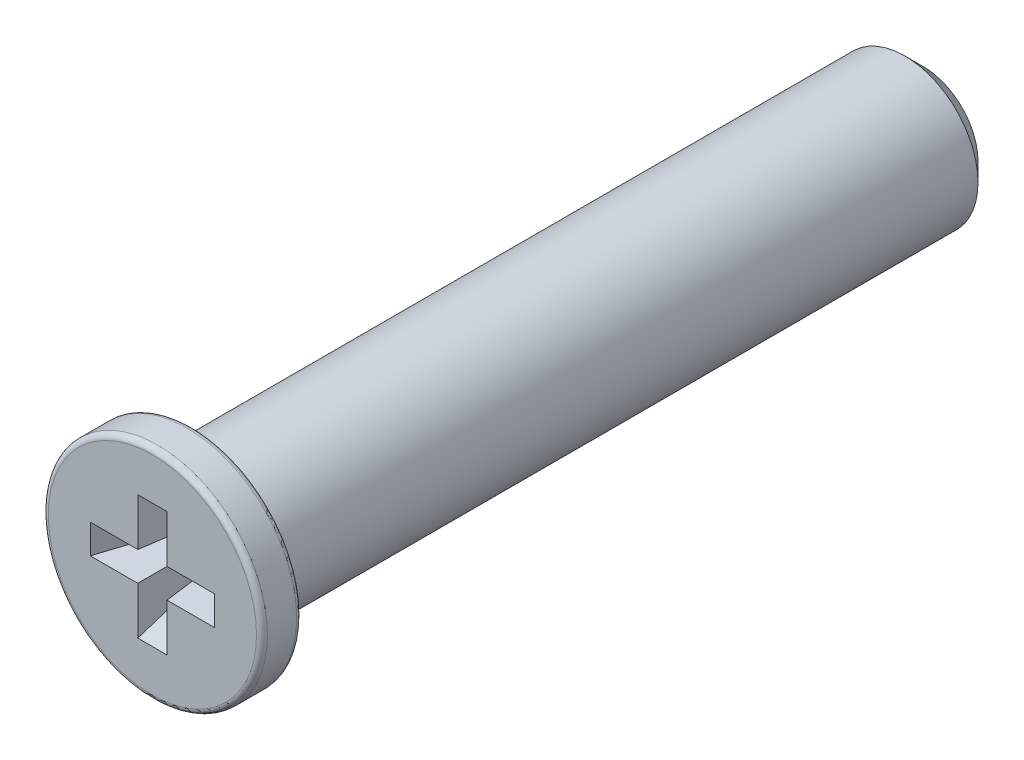
ISO-10303-21;
HEADER;
FILE_DESCRIPTION(('STEP AP214'),'2;1');
FILE_NAME('part.step','',(''),(''),'','','');
FILE_SCHEMA(('AUTOMOTIVE_DESIGN { 1 0 10303 214 1 1 1 1 }'));
ENDSEC;
DATA;
#1=APPLICATION_CONTEXT('core data for automotive mechanical design processes');
#2=APPLICATION_PROTOCOL_DEFINITION('international standard','automotive_design',2000,#1);
#3=PRODUCT_CONTEXT('',#1,'mechanical');
#4=PRODUCT('Part','Part','',(#3));
#5=PRODUCT_RELATED_PRODUCT_CATEGORY('part','',(#4));
#6=PRODUCT_DEFINITION_FORMATION('','',#4);
#7=PRODUCT_DEFINITION_CONTEXT('part definition',#1,'design');
#8=PRODUCT_DEFINITION('design','',#6,#7);
#9=PRODUCT_DEFINITION_SHAPE('','',#8);
#10=(LENGTH_UNIT() NAMED_UNIT(*) SI_UNIT(.MILLI.,.METRE.));
#11=(NAMED_UNIT(*) PLANE_ANGLE_UNIT() SI_UNIT($,.RADIAN.));
#12=(NAMED_UNIT(*) SI_UNIT($,.STERADIAN.) SOLID_ANGLE_UNIT());
#13=UNCERTAINTY_MEASURE_WITH_UNIT(LENGTH_MEASURE(1.E-05),#10,'distance_accuracy_value','');
#14=(GEOMETRIC_REPRESENTATION_CONTEXT(3) GLOBAL_UNCERTAINTY_ASSIGNED_CONTEXT((#13)) GLOBAL_UNIT_ASSIGNED_CONTEXT((#10,
#11,#12)) REPRESENTATION_CONTEXT('',''));
#15=CARTESIAN_POINT('',(0.,0.,0.));
#16=DIRECTION('',(0.,0.,1.));
#17=DIRECTION('',(1.,0.,0.));
#18=AXIS2_PLACEMENT_3D('',#15,#16,#17);
#19=CARTESIAN_POINT('',(12.1,-11.25,7.5));
#20=DIRECTION('',(-0.923879532511287,0.,0.38268343236509));
#21=DIRECTION('',(0.38268343236509,0.,0.923879532511287));
#22=AXIS2_PLACEMENT_3D('',#19,#20,#21);
#23=PLANE('',#22);
#24=DIRECTION('',(0.,1.,0.));
#25=VECTOR('',#24,1.);
#26=CARTESIAN_POINT('',(11.6029437251523,-11.25,6.30000000000001));
#27=LINE('',#26,#25);
#28=CARTESIAN_POINT('',(11.6029437251523,-11.1339121743322,6.3));
#29=VERTEX_POINT('',#28);
#30=CARTESIAN_POINT('',(11.6029437251523,-11.3660878256678,6.3));
#31=VERTEX_POINT('',#30);
#32=EDGE_CURVE('E117',#29,#31,#27,.F.);
#33=ORIENTED_EDGE('',*,*,#32,.T.);
#34=DIRECTION('',(-0.381887326256782,0.0644695530821726,-0.921957562347547));
#35=VECTOR('',#34,1.);
#36=CARTESIAN_POINT('',(12.1,-11.45,7.5));
#37=LINE('',#36,#35);
#38=CARTESIAN_POINT('',(12.1,-11.45,7.5));
#39=VERTEX_POINT('',#38);
#40=EDGE_CURVE('E133',#39,#31,#37,.T.);
#41=ORIENTED_EDGE('',*,*,#40,.F.);
#42=DIRECTION('',(0.,1.,0.));
#43=VECTOR('',#42,1.);
#44=CARTESIAN_POINT('',(12.1,-11.25,7.5));
#45=LINE('',#44,#43);
#46=CARTESIAN_POINT('',(12.1,-11.05,7.5));
#47=VERTEX_POINT('',#46);
#48=EDGE_CURVE('E122',#39,#47,#45,.T.);
#49=ORIENTED_EDGE('',*,*,#48,.T.);
#50=DIRECTION('',(0.381887326256781,0.0644695530821739,0.921957562347547));
#51=VECTOR('',#50,1.);
#52=CARTESIAN_POINT('',(11.6029437251523,-11.1339121743322,6.3));
#53=LINE('',#52,#51);
#54=EDGE_CURVE('E286',#29,#47,#53,.T.);
#55=ORIENTED_EDGE('',*,*,#54,.F.);
#56=EDGE_LOOP('',(#33,#41,#49,#55));
#57=FACE_BOUND('',#56,.T.);
#58=ADVANCED_FACE('F17',(#57),#23,.T.);
#59=CARTESIAN_POINT('',(11.25,-11.45,7.5));
#60=DIRECTION('',(0.,0.997564050259824,0.0697564737441253));
#61=DIRECTION('',(0.,-0.0697564737441253,0.997564050259824));
#62=AXIS2_PLACEMENT_3D('',#59,#60,#61);
#63=PLANE('',#62);
#64=DIRECTION('',(1.,0.,0.));
#65=VECTOR('',#64,1.);
#66=CARTESIAN_POINT('',(11.25,-11.3660878256678,6.3));
#67=LINE('',#66,#65);
#68=CARTESIAN_POINT('',(11.3660878256678,-11.3660878256678,6.3));
#69=VERTEX_POINT('',#68);
#70=EDGE_CURVE('E135',#31,#69,#67,.F.);
#71=ORIENTED_EDGE('',*,*,#70,.T.);
#72=DIRECTION('',(-0.0695873743166644,0.0695873743166544,-0.995145815783509));
#73=VECTOR('',#72,1.);
#74=CARTESIAN_POINT('',(11.45,-11.45,7.5));
#75=LINE('',#74,#73);
#76=CARTESIAN_POINT('',(11.45,-11.45,7.5));
#77=VERTEX_POINT('',#76);
#78=EDGE_CURVE('E139',#77,#69,#75,.T.);
#79=ORIENTED_EDGE('',*,*,#78,.F.);
#80=DIRECTION('',(1.,0.,0.));
#81=VECTOR('',#80,1.);
#82=CARTESIAN_POINT('',(11.25,-11.45,7.5));
#83=LINE('',#82,#81);
#84=EDGE_CURVE('E126',#77,#39,#83,.T.);
#85=ORIENTED_EDGE('',*,*,#84,.T.);
#86=ORIENTED_EDGE('',*,*,#40,.T.);
#87=EDGE_LOOP('',(#71,#79,#85,#86));
#88=FACE_BOUND('',#87,.T.);
#89=ADVANCED_FACE('F137',(#88),#63,.T.);
#90=CARTESIAN_POINT('',(11.25,-11.05,7.5));
#91=DIRECTION('',(0.,-0.997564050259824,0.0697564737441253));
#92=DIRECTION('',(0.,-0.0697564737441253,-0.997564050259824));
#93=AXIS2_PLACEMENT_3D('',#90,#91,#92);
#94=PLANE('',#93);
#95=DIRECTION('',(1.,0.,0.));
#96=VECTOR('',#95,1.);
#97=CARTESIAN_POINT('',(11.25,-11.1339121743322,6.3));
#98=LINE('',#97,#96);
#99=CARTESIAN_POINT('',(11.3660878256678,-11.1339121743322,6.3));
#100=VERTEX_POINT('',#99);
#101=EDGE_CURVE('E288',#100,#29,#98,.T.);
#102=ORIENTED_EDGE('',*,*,#101,.T.);
#103=ORIENTED_EDGE('',*,*,#54,.T.);
#104=DIRECTION('',(1.,0.,0.));
#105=VECTOR('',#104,1.);
#106=CARTESIAN_POINT('',(11.25,-11.05,7.5));
#107=LINE('',#106,#105);
#108=CARTESIAN_POINT('',(11.45,-11.05,7.5));
#109=VERTEX_POINT('',#108);
#110=EDGE_CURVE('E129',#47,#109,#107,.F.);
#111=ORIENTED_EDGE('',*,*,#110,.T.);
#112=DIRECTION('',(0.0695873743166644,0.0695873743166544,0.995145815783509));
#113=VECTOR('',#112,1.);
#114=CARTESIAN_POINT('',(11.3660878256678,-11.1339121743322,6.3));
#115=LINE('',#114,#113);
#116=EDGE_CURVE('E272',#100,#109,#115,.T.);
#117=ORIENTED_EDGE('',*,*,#116,.F.);
#118=EDGE_LOOP('',(#102,#103,#111,#117));
#119=FACE_BOUND('',#118,.T.);
#120=ADVANCED_FACE('F459',(#119),#94,.T.);
#121=CARTESIAN_POINT('',(11.45,-11.25,7.5));
#122=DIRECTION('',(-0.997564050259824,0.,0.0697564737441253));
#123=DIRECTION('',(0.0697564737441253,0.,0.997564050259824));
#124=AXIS2_PLACEMENT_3D('',#121,#122,#123);
#125=PLANE('',#124);
#126=DIRECTION('',(0.,1.,0.));
#127=VECTOR('',#126,1.);
#128=CARTESIAN_POINT('',(11.3660878256678,-11.25,6.3));
#129=LINE('',#128,#127);
#130=CARTESIAN_POINT('',(11.3660878256678,-11.6029437251523,6.3));
#131=VERTEX_POINT('',#130);
#132=EDGE_CURVE('E281',#69,#131,#129,.F.);
#133=ORIENTED_EDGE('',*,*,#132,.T.);
#134=DIRECTION('',(-0.0644695530821646,0.381887326256791,-0.921957562347544));
#135=VECTOR('',#134,1.);
#136=CARTESIAN_POINT('',(11.45,-12.1,7.5));
#137=LINE('',#136,#135);
#138=CARTESIAN_POINT('',(11.45,-12.1,7.5));
#139=VERTEX_POINT('',#138);
#140=EDGE_CURVE('E266',#139,#131,#137,.T.);
#141=ORIENTED_EDGE('',*,*,#140,.F.);
#142=DIRECTION('',(0.,1.,0.));
#143=VECTOR('',#142,1.);
#144=CARTESIAN_POINT('',(11.45,-11.25,7.5));
#145=LINE('',#144,#143);
#146=EDGE_CURVE('E284',#139,#77,#145,.T.);
#147=ORIENTED_EDGE('',*,*,#146,.T.);
#148=ORIENTED_EDGE('',*,*,#78,.T.);
#149=EDGE_LOOP('',(#133,#141,#147,#148));
#150=FACE_BOUND('',#149,.T.);
#151=ADVANCED_FACE('F298',(#150),#125,.T.);
#152=CARTESIAN_POINT('',(11.45,-11.25,7.5));
#153=DIRECTION('',(-0.997564050259824,0.,0.0697564737441253));
#154=DIRECTION('',(0.0697564737441253,0.,0.997564050259824));
#155=AXIS2_PLACEMENT_3D('',#152,#153,#154);
#156=PLANE('',#155);
#157=DIRECTION('',(0.,1.,0.));
#158=VECTOR('',#157,1.);
#159=CARTESIAN_POINT('',(11.3660878256678,-11.25,6.3));
#160=LINE('',#159,#158);
#161=CARTESIAN_POINT('',(11.3660878256678,-10.8970562748477,6.3));
#162=VERTEX_POINT('',#161);
#163=EDGE_CURVE('E275',#162,#100,#160,.F.);
#164=ORIENTED_EDGE('',*,*,#163,.T.);
#165=ORIENTED_EDGE('',*,*,#116,.T.);
#166=DIRECTION('',(0.,1.,0.));
#167=VECTOR('',#166,1.);
#168=CARTESIAN_POINT('',(11.45,-11.25,7.5));
#169=LINE('',#168,#167);
#170=CARTESIAN_POINT('',(11.45,-10.4,7.5));
#171=VERTEX_POINT('',#170);
#172=EDGE_CURVE('E278',#109,#171,#169,.T.);
#173=ORIENTED_EDGE('',*,*,#172,.T.);
#174=DIRECTION('',(0.0644695530821647,0.381887326256791,0.921957562347544));
#175=VECTOR('',#174,1.);
#176=CARTESIAN_POINT('',(11.3660878256678,-10.8970562748477,6.30000000000001));
#177=LINE('',#176,#175);
#178=EDGE_CURVE('E255',#162,#171,#177,.T.);
#179=ORIENTED_EDGE('',*,*,#178,.F.);
#180=EDGE_LOOP('',(#164,#165,#173,#179));
#181=FACE_BOUND('',#180,.T.);
#182=ADVANCED_FACE('F445',(#181),#156,.T.);
#183=CARTESIAN_POINT('',(11.25,-12.1,7.5));
#184=DIRECTION('',(0.,0.923879532511287,0.38268343236509));
#185=DIRECTION('',(0.,-0.38268343236509,0.923879532511287));
#186=AXIS2_PLACEMENT_3D('',#183,#184,#185);
#187=PLANE('',#186);
#188=DIRECTION('',(1.,0.,0.));
#189=VECTOR('',#188,1.);
#190=CARTESIAN_POINT('',(11.25,-11.6029437251523,6.30000000000001));
#191=LINE('',#190,#189);
#192=CARTESIAN_POINT('',(11.1339121743322,-11.6029437251523,6.3));
#193=VERTEX_POINT('',#192);
#194=EDGE_CURVE('E264',#131,#193,#191,.F.);
#195=ORIENTED_EDGE('',*,*,#194,.T.);
#196=DIRECTION('',(0.0644695530821726,0.381887326256782,-0.921957562347547));
#197=VECTOR('',#196,1.);
#198=CARTESIAN_POINT('',(11.05,-12.1,7.5));
#199=LINE('',#198,#197);
#200=CARTESIAN_POINT('',(11.05,-12.1,7.5));
#201=VERTEX_POINT('',#200);
#202=EDGE_CURVE('E249',#201,#193,#199,.T.);
#203=ORIENTED_EDGE('',*,*,#202,.F.);
#204=DIRECTION('',(1.,0.,0.));
#205=VECTOR('',#204,1.);
#206=CARTESIAN_POINT('',(11.25,-12.1,7.5));
#207=LINE('',#206,#205);
#208=EDGE_CURVE('E269',#201,#139,#207,.T.);
#209=ORIENTED_EDGE('',*,*,#208,.T.);
#210=ORIENTED_EDGE('',*,*,#140,.T.);
#211=EDGE_LOOP('',(#195,#203,#209,#210));
#212=FACE_BOUND('',#211,.T.);
#213=ADVANCED_FACE('F302',(#212),#187,.T.);
#214=CARTESIAN_POINT('',(11.25,-10.4,7.5));
#215=DIRECTION('',(0.,-0.923879532511287,0.38268343236509));
#216=DIRECTION('',(0.,-0.38268343236509,-0.923879532511287));
#217=AXIS2_PLACEMENT_3D('',#214,#215,#216);
#218=PLANE('',#217);
#219=DIRECTION('',(1.,0.,0.));
#220=VECTOR('',#219,1.);
#221=CARTESIAN_POINT('',(11.25,-10.8970562748477,6.30000000000001));
#222=LINE('',#221,#220);
#223=CARTESIAN_POINT('',(11.1339121743322,-10.8970562748477,6.3));
#224=VERTEX_POINT('',#223);
#225=EDGE_CURVE('E258',#224,#162,#222,.T.);
#226=ORIENTED_EDGE('',*,*,#225,.T.);
#227=ORIENTED_EDGE('',*,*,#178,.T.);
#228=DIRECTION('',(1.,0.,0.));
#229=VECTOR('',#228,1.);
#230=CARTESIAN_POINT('',(11.25,-10.4,7.5));
#231=LINE('',#230,#229);
#232=CARTESIAN_POINT('',(11.05,-10.4,7.5));
#233=VERTEX_POINT('',#232);
#234=EDGE_CURVE('E261',#171,#233,#231,.F.);
#235=ORIENTED_EDGE('',*,*,#234,.T.);
#236=DIRECTION('',(-0.064469553082174,0.38188732625678,0.921957562347548));
#237=VECTOR('',#236,1.);
#238=CARTESIAN_POINT('',(11.1339121743322,-10.8970562748477,6.3));
#239=LINE('',#238,#237);
#240=EDGE_CURVE('E241',#224,#233,#239,.T.);
#241=ORIENTED_EDGE('',*,*,#240,.F.);
#242=EDGE_LOOP('',(#226,#227,#235,#241));
#243=FACE_BOUND('',#242,.T.);
#244=ADVANCED_FACE('F431',(#243),#218,.T.);
#245=CARTESIAN_POINT('',(11.05,-11.25,7.5));
#246=DIRECTION('',(0.997564050259824,0.,0.0697564737441253));
#247=DIRECTION('',(0.0697564737441253,0.,-0.997564050259824));
#248=AXIS2_PLACEMENT_3D('',#245,#246,#247);
#249=PLANE('',#248);
#250=DIRECTION('',(0.,1.,0.));
#251=VECTOR('',#250,1.);
#252=CARTESIAN_POINT('',(11.1339121743322,-11.25,6.3));
#253=LINE('',#252,#251);
#254=CARTESIAN_POINT('',(11.1339121743322,-11.3660878256678,6.3));
#255=VERTEX_POINT('',#254);
#256=EDGE_CURVE('E247',#193,#255,#253,.T.);
#257=ORIENTED_EDGE('',*,*,#256,.T.);
#258=DIRECTION('',(0.0695873743166544,0.0695873743166644,-0.995145815783509));
#259=VECTOR('',#258,1.);
#260=CARTESIAN_POINT('',(11.05,-11.45,7.5));
#261=LINE('',#260,#259);
#262=CARTESIAN_POINT('',(11.05,-11.45,7.5));
#263=VERTEX_POINT('',#262);
#264=EDGE_CURVE('E235',#263,#255,#261,.T.);
#265=ORIENTED_EDGE('',*,*,#264,.F.);
#266=DIRECTION('',(0.,1.,0.));
#267=VECTOR('',#266,1.);
#268=CARTESIAN_POINT('',(11.05,-11.25,7.5));
#269=LINE('',#268,#267);
#270=EDGE_CURVE('E252',#263,#201,#269,.F.);
#271=ORIENTED_EDGE('',*,*,#270,.T.);
#272=ORIENTED_EDGE('',*,*,#202,.T.);
#273=EDGE_LOOP('',(#257,#265,#271,#272));
#274=FACE_BOUND('',#273,.T.);
#275=ADVANCED_FACE('F304',(#274),#249,.T.);
#276=CARTESIAN_POINT('',(11.05,-11.25,7.5));
#277=DIRECTION('',(0.997564050259824,0.,0.0697564737441253));
#278=DIRECTION('',(0.0697564737441253,0.,-0.997564050259824));
#279=AXIS2_PLACEMENT_3D('',#276,#277,#278);
#280=PLANE('',#279);
#281=DIRECTION('',(0.,1.,0.));
#282=VECTOR('',#281,1.);
#283=CARTESIAN_POINT('',(11.1339121743322,-11.25,6.3));
#284=LINE('',#283,#282);
#285=CARTESIAN_POINT('',(11.1339121743322,-11.1339121743322,6.3));
#286=VERTEX_POINT('',#285);
#287=EDGE_CURVE('E230',#224,#286,#284,.F.);
#288=ORIENTED_EDGE('',*,*,#287,.F.);
#289=ORIENTED_EDGE('',*,*,#240,.T.);
#290=DIRECTION('',(0.,1.,0.));
#291=VECTOR('',#290,1.);
#292=CARTESIAN_POINT('',(11.05,-11.25,7.5));
#293=LINE('',#292,#291);
#294=CARTESIAN_POINT('',(11.05,-11.05,7.5));
#295=VERTEX_POINT('',#294);
#296=EDGE_CURVE('E244',#233,#295,#293,.F.);
#297=ORIENTED_EDGE('',*,*,#296,.T.);
#298=DIRECTION('',(-0.0695873743166544,0.0695873743166644,0.995145815783509));
#299=VECTOR('',#298,1.);
#300=CARTESIAN_POINT('',(11.1339121743322,-11.1339121743322,6.3));
#301=LINE('',#300,#299);
#302=EDGE_CURVE('E222',#286,#295,#301,.T.);
#303=ORIENTED_EDGE('',*,*,#302,.F.);
#304=EDGE_LOOP('',(#288,#289,#297,#303));
#305=FACE_BOUND('',#304,.T.);
#306=ADVANCED_FACE('F417',(#305),#280,.T.);
#307=CARTESIAN_POINT('',(11.25,-11.45,7.5));
#308=DIRECTION('',(0.,0.997564050259824,0.0697564737441253));
#309=DIRECTION('',(0.,-0.0697564737441253,0.997564050259824));
#310=AXIS2_PLACEMENT_3D('',#307,#308,#309);
#311=PLANE('',#310);
#312=DIRECTION('',(1.,0.,0.));
#313=VECTOR('',#312,1.);
#314=CARTESIAN_POINT('',(11.25,-11.3660878256678,6.3));
#315=LINE('',#314,#313);
#316=CARTESIAN_POINT('',(10.8970562748477,-11.3660878256678,6.3));
#317=VERTEX_POINT('',#316);
#318=EDGE_CURVE('E232',#317,#255,#315,.T.);
#319=ORIENTED_EDGE('',*,*,#318,.F.);
#320=DIRECTION('',(0.381887326256791,0.0644695530821647,-0.921957562347544));
#321=VECTOR('',#320,1.);
#322=CARTESIAN_POINT('',(10.4,-11.45,7.5));
#323=LINE('',#322,#321);
#324=CARTESIAN_POINT('',(10.4,-11.45,7.5));
#325=VERTEX_POINT('',#324);
#326=EDGE_CURVE('E219',#325,#317,#323,.T.);
#327=ORIENTED_EDGE('',*,*,#326,.F.);
#328=DIRECTION('',(1.,0.,0.));
#329=VECTOR('',#328,1.);
#330=CARTESIAN_POINT('',(11.25,-11.45,7.5));
#331=LINE('',#330,#329);
#332=EDGE_CURVE('E238',#325,#263,#331,.T.);
#333=ORIENTED_EDGE('',*,*,#332,.T.);
#334=ORIENTED_EDGE('',*,*,#264,.T.);
#335=EDGE_LOOP('',(#319,#327,#333,#334));
#336=FACE_BOUND('',#335,.T.);
#337=ADVANCED_FACE('F307',(#336),#311,.T.);
#338=CARTESIAN_POINT('',(11.25,-11.25,6.3));
#339=DIRECTION('',(0.,0.,1.));
#340=DIRECTION('',(1.,0.,0.));
#341=AXIS2_PLACEMENT_3D('',#338,#339,#340);
#342=PLANE('',#341);
#343=ORIENTED_EDGE('',*,*,#225,.F.);
#344=ORIENTED_EDGE('',*,*,#287,.T.);
#345=DIRECTION('',(1.,0.,0.));
#346=VECTOR('',#345,1.);
#347=CARTESIAN_POINT('',(11.25,-11.1339121743322,6.3));
#348=LINE('',#347,#346);
#349=CARTESIAN_POINT('',(10.8970562748477,-11.1339121743322,6.3));
#350=VERTEX_POINT('',#349);
#351=EDGE_CURVE('E225',#350,#286,#348,.T.);
#352=ORIENTED_EDGE('',*,*,#351,.F.);
#353=DIRECTION('',(0.,1.,0.));
#354=VECTOR('',#353,1.);
#355=CARTESIAN_POINT('',(10.8970562748477,-11.25,6.30000000000001));
#356=LINE('',#355,#354);
#357=EDGE_CURVE('E216',#317,#350,#356,.T.);
#358=ORIENTED_EDGE('',*,*,#357,.F.);
#359=ORIENTED_EDGE('',*,*,#318,.T.);
#360=ORIENTED_EDGE('',*,*,#256,.F.);
#361=ORIENTED_EDGE('',*,*,#194,.F.);
#362=ORIENTED_EDGE('',*,*,#132,.F.);
#363=ORIENTED_EDGE('',*,*,#70,.F.);
#364=ORIENTED_EDGE('',*,*,#32,.F.);
#365=ORIENTED_EDGE('',*,*,#101,.F.);
#366=ORIENTED_EDGE('',*,*,#163,.F.);
#367=EDGE_LOOP('',(#343,#344,#352,#358,#359,#360,#361,#362,#363,#364,#365,#366));
#368=FACE_BOUND('',#367,.T.);
#369=ADVANCED_FACE('F294',(#368),#342,.T.);
#370=CARTESIAN_POINT('',(11.25,-11.05,7.5));
#371=DIRECTION('',(0.,-0.997564050259824,0.0697564737441253));
#372=DIRECTION('',(0.,-0.0697564737441253,-0.997564050259824));
#373=AXIS2_PLACEMENT_3D('',#370,#371,#372);
#374=PLANE('',#373);
#375=ORIENTED_EDGE('',*,*,#351,.T.);
#376=ORIENTED_EDGE('',*,*,#302,.T.);
#377=DIRECTION('',(1.,0.,0.));
#378=VECTOR('',#377,1.);
#379=CARTESIAN_POINT('',(11.25,-11.05,7.5));
#380=LINE('',#379,#378);
#381=CARTESIAN_POINT('',(10.4,-11.05,7.5));
#382=VERTEX_POINT('',#381);
#383=EDGE_CURVE('E228',#295,#382,#380,.F.);
#384=ORIENTED_EDGE('',*,*,#383,.T.);
#385=DIRECTION('',(-0.381887326256791,0.0644695530821647,0.921957562347544));
#386=VECTOR('',#385,1.);
#387=CARTESIAN_POINT('',(10.8970562748477,-11.1339121743322,6.30000000000001));
#388=LINE('',#387,#386);
#389=EDGE_CURVE('E207',#350,#382,#388,.T.);
#390=ORIENTED_EDGE('',*,*,#389,.F.);
#391=EDGE_LOOP('',(#375,#376,#384,#390));
#392=FACE_BOUND('',#391,.T.);
#393=ADVANCED_FACE('F336',(#392),#374,.T.);
#394=CARTESIAN_POINT('',(10.4,-11.25,7.5));
#395=DIRECTION('',(0.923879532511287,0.,0.38268343236509));
#396=DIRECTION('',(0.38268343236509,0.,-0.923879532511287));
#397=AXIS2_PLACEMENT_3D('',#394,#395,#396);
#398=PLANE('',#397);
#399=ORIENTED_EDGE('',*,*,#357,.T.);
#400=ORIENTED_EDGE('',*,*,#389,.T.);
#401=DIRECTION('',(0.,1.,0.));
#402=VECTOR('',#401,1.);
#403=CARTESIAN_POINT('',(10.4,-11.25,7.5));
#404=LINE('',#403,#402);
#405=EDGE_CURVE('E215',#382,#325,#404,.F.);
#406=ORIENTED_EDGE('',*,*,#405,.T.);
#407=ORIENTED_EDGE('',*,*,#326,.T.);
#408=EDGE_LOOP('',(#399,#400,#406,#407));
#409=FACE_BOUND('',#408,.T.);
#410=ADVANCED_FACE('F331',(#409),#398,.T.);
#411=CARTESIAN_POINT('',(11.25,-11.25,7.5));
#412=DIRECTION('',(0.,0.,-1.));
#413=DIRECTION('',(-1.,0.,0.));
#414=AXIS2_PLACEMENT_3D('',#411,#412,#413);
#415=PLANE('',#414);
#416=ORIENTED_EDGE('',*,*,#383,.F.);
#417=ORIENTED_EDGE('',*,*,#296,.F.);
#418=ORIENTED_EDGE('',*,*,#234,.F.);
#419=ORIENTED_EDGE('',*,*,#172,.F.);
#420=ORIENTED_EDGE('',*,*,#110,.F.);
#421=ORIENTED_EDGE('',*,*,#48,.F.);
#422=ORIENTED_EDGE('',*,*,#84,.F.);
#423=ORIENTED_EDGE('',*,*,#146,.F.);
#424=ORIENTED_EDGE('',*,*,#208,.F.);
#425=ORIENTED_EDGE('',*,*,#270,.F.);
#426=ORIENTED_EDGE('',*,*,#332,.F.);
#427=ORIENTED_EDGE('',*,*,#405,.F.);
#428=EDGE_LOOP('',(#416,#417,#418,#419,#420,#421,#422,#423,#424,#425,#426,#427));
#429=FACE_BOUND('',#428,.T.);
#430=CARTESIAN_POINT('',(11.25,-11.25,7.5));
#431=DIRECTION('',(0.,0.,-1.));
#432=DIRECTION('',(-1.,0.,0.));
#433=AXIS2_PLACEMENT_3D('',#430,#431,#432);
#434=CIRCLE('',#433,1.425);
#435=CARTESIAN_POINT('',(9.825,-11.25,7.5));
#436=VERTEX_POINT('',#435);
#437=CARTESIAN_POINT('',(12.675,-11.25,7.5));
#438=VERTEX_POINT('',#437);
#439=EDGE_CURVE('E311',#436,#438,#434,.T.);
#440=ORIENTED_EDGE('',*,*,#439,.F.);
#441=CARTESIAN_POINT('',(11.25,-11.25,7.5));
#442=DIRECTION('',(0.,0.,-1.));
#443=DIRECTION('',(1.,0.,0.));
#444=AXIS2_PLACEMENT_3D('',#441,#442,#443);
#445=CIRCLE('',#444,1.425);
#446=EDGE_CURVE('E187',#438,#436,#445,.T.);
#447=ORIENTED_EDGE('',*,*,#446,.F.);
#448=EDGE_LOOP('',(#440,#447));
#449=FACE_BOUND('',#448,.T.);
#450=ADVANCED_FACE('F123',(#429,#449),#415,.F.);
#451=CARTESIAN_POINT('',(11.25,-11.25,7.425));
#452=DIRECTION('',(0.,0.,-1.));
#453=DIRECTION('',(-1.,0.,0.));
#454=AXIS2_PLACEMENT_3D('',#451,#452,#453);
#455=TOROIDAL_SURFACE('',#454,1.425,0.075);
#456=CARTESIAN_POINT('',(11.25,-11.25,7.425));
#457=DIRECTION('',(0.,0.,1.));
#458=DIRECTION('',(1.,0.,0.));
#459=AXIS2_PLACEMENT_3D('',#456,#457,#458);
#460=CIRCLE('',#459,1.5);
#461=CARTESIAN_POINT('',(12.75,-11.25,7.425));
#462=VERTEX_POINT('',#461);
#463=EDGE_CURVE('E184',#462,#462,#460,.F.);
#464=ORIENTED_EDGE('',*,*,#463,.F.);
#465=EDGE_LOOP('',(#464));
#466=FACE_BOUND('',#465,.T.);
#467=ORIENTED_EDGE('',*,*,#446,.T.);
#468=ORIENTED_EDGE('',*,*,#439,.T.);
#469=EDGE_LOOP('',(#467,#468));
#470=FACE_BOUND('',#469,.T.);
#471=ADVANCED_FACE('F191',(#466,#470),#455,.T.);
#472=CARTESIAN_POINT('',(11.25,-11.25,6.95));
#473=DIRECTION('',(0.,0.,1.));
#474=DIRECTION('',(1.,0.,0.));
#475=AXIS2_PLACEMENT_3D('',#472,#473,#474);
#476=CYLINDRICAL_SURFACE('',#475,1.5);
#477=ORIENTED_EDGE('',*,*,#463,.T.);
#478=EDGE_LOOP('',(#477));
#479=FACE_BOUND('',#478,.T.);
#480=CARTESIAN_POINT('',(11.25,-11.25,7.025));
#481=DIRECTION('',(0.,0.,-1.));
#482=DIRECTION('',(-1.,0.,0.));
#483=AXIS2_PLACEMENT_3D('',#480,#481,#482);
#484=CIRCLE('',#483,1.5);
#485=CARTESIAN_POINT('',(9.75,-11.25,7.025));
#486=VERTEX_POINT('',#485);
#487=EDGE_CURVE('E149',#486,#486,#484,.T.);
#488=ORIENTED_EDGE('',*,*,#487,.F.);
#489=EDGE_LOOP('',(#488));
#490=FACE_BOUND('',#489,.T.);
#491=ADVANCED_FACE('F195',(#479,#490),#476,.T.);
#492=CARTESIAN_POINT('',(11.25,-11.25,-3.05));
#493=DIRECTION('',(0.,0.,-1.));
#494=DIRECTION('',(-1.,0.,0.));
#495=AXIS2_PLACEMENT_3D('',#492,#493,#494);
#496=PLANE('',#495);
#497=CARTESIAN_POINT('',(11.25,-11.25,-3.04999999997335));
#498=DIRECTION('',(0.,0.,1.));
#499=DIRECTION('',(1.,0.,0.));
#500=AXIS2_PLACEMENT_3D('',#497,#498,#499);
#501=CIRCLE('',#500,0.750000000000455);
#502=CARTESIAN_POINT('',(12.0000000000005,-11.25,-3.04999999997335));
#503=VERTEX_POINT('',#502);
#504=EDGE_CURVE('E145',#503,#503,#501,.T.);
#505=ORIENTED_EDGE('',*,*,#504,.F.);
#506=EDGE_LOOP('',(#505));
#507=FACE_BOUND('',#506,.T.);
#508=ADVANCED_FACE('F166',(#507),#496,.T.);
#509=CARTESIAN_POINT('',(11.25,-11.25,7.025));
#510=DIRECTION('',(0.,0.,-1.));
#511=DIRECTION('',(-1.,0.,0.));
#512=AXIS2_PLACEMENT_3D('',#509,#510,#511);
#513=TOROIDAL_SURFACE('',#512,1.425,0.075);
#514=CARTESIAN_POINT('',(11.25,-11.25,6.95));
#515=DIRECTION('',(0.,0.,1.));
#516=DIRECTION('',(1.,0.,0.));
#517=AXIS2_PLACEMENT_3D('',#514,#515,#516);
#518=CIRCLE('',#517,1.425);
#519=CARTESIAN_POINT('',(9.825,-11.25,6.95));
#520=VERTEX_POINT('',#519);
#521=CARTESIAN_POINT('',(12.675,-11.25,6.95));
#522=VERTEX_POINT('',#521);
#523=EDGE_CURVE('E148',#520,#522,#518,.F.);
#524=ORIENTED_EDGE('',*,*,#523,.F.);
#525=CARTESIAN_POINT('',(11.25,-11.25,6.95));
#526=DIRECTION('',(0.,0.,1.));
#527=DIRECTION('',(-1.,0.,0.));
#528=AXIS2_PLACEMENT_3D('',#525,#526,#527);
#529=CIRCLE('',#528,1.425);
#530=EDGE_CURVE('E36',#522,#520,#529,.F.);
#531=ORIENTED_EDGE('',*,*,#530,.F.);
#532=EDGE_LOOP('',(#524,#531));
#533=FACE_BOUND('',#532,.T.);
#534=ORIENTED_EDGE('',*,*,#487,.T.);
#535=EDGE_LOOP('',(#534));
#536=FACE_BOUND('',#535,.T.);
#537=ADVANCED_FACE('F154',(#533,#536),#513,.T.);
#538=CARTESIAN_POINT('',(11.25,-11.25,-2.79999999980873));
#539=DIRECTION('',(0.,0.,1.));
#540=DIRECTION('',(1.,0.,0.));
#541=AXIS2_PLACEMENT_3D('',#538,#539,#540);
#542=CONICAL_SURFACE('',#541,0.999999999710326,0.785398162487954);
#543=ORIENTED_EDGE('',*,*,#504,.T.);
#544=EDGE_LOOP('',(#543));
#545=FACE_BOUND('',#544,.T.);
#546=CARTESIAN_POINT('',(11.25,-11.25,-2.8));
#547=DIRECTION('',(0.,0.,1.));
#548=DIRECTION('',(1.,0.,0.));
#549=AXIS2_PLACEMENT_3D('',#546,#547,#548);
#550=CIRCLE('',#549,1.);
#551=CARTESIAN_POINT('',(12.25,-11.25,-2.8));
#552=VERTEX_POINT('',#551);
#553=EDGE_CURVE('E28',#552,#552,#550,.T.);
#554=ORIENTED_EDGE('',*,*,#553,.F.);
#555=EDGE_LOOP('',(#554));
#556=FACE_BOUND('',#555,.T.);
#557=ADVANCED_FACE('F165',(#545,#556),#542,.T.);
#558=CARTESIAN_POINT('',(11.25,-11.25,6.95));
#559=DIRECTION('',(0.,0.,-1.));
#560=DIRECTION('',(-1.,0.,0.));
#561=AXIS2_PLACEMENT_3D('',#558,#559,#560);
#562=PLANE('',#561);
#563=CARTESIAN_POINT('',(11.25,-11.25,6.95));
#564=DIRECTION('',(0.,0.,1.));
#565=DIRECTION('',(1.,0.,0.));
#566=AXIS2_PLACEMENT_3D('',#563,#564,#565);
#567=CIRCLE('',#566,1.);
#568=CARTESIAN_POINT('',(12.25,-11.25,6.95));
#569=VERTEX_POINT('',#568);
#570=EDGE_CURVE('E11',#569,#569,#567,.F.);
#571=ORIENTED_EDGE('',*,*,#570,.F.);
#572=EDGE_LOOP('',(#571));
#573=FACE_BOUND('',#572,.T.);
#574=ORIENTED_EDGE('',*,*,#523,.T.);
#575=ORIENTED_EDGE('',*,*,#530,.T.);
#576=EDGE_LOOP('',(#574,#575));
#577=FACE_BOUND('',#576,.T.);
#578=ADVANCED_FACE('F339',(#573,#577),#562,.T.);
#579=CARTESIAN_POINT('',(11.25,-11.25,-3.05));
#580=DIRECTION('',(0.,0.,1.));
#581=DIRECTION('',(1.,0.,0.));
#582=AXIS2_PLACEMENT_3D('',#579,#580,#581);
#583=CYLINDRICAL_SURFACE('',#582,1.);
#584=ORIENTED_EDGE('',*,*,#553,.T.);
#585=EDGE_LOOP('',(#584));
#586=FACE_BOUND('',#585,.T.);
#587=ORIENTED_EDGE('',*,*,#570,.T.);
#588=EDGE_LOOP('',(#587));
#589=FACE_BOUND('',#588,.T.);
#590=ADVANCED_FACE('F337',(#586,#589),#583,.T.);
#591=CLOSED_SHELL('',(#58,#89,#120,#151,#182,#213,#244,#275,#306,#337,#369,#393,#410,#450,#471,
#491,#508,#537,#557,#578,#590));
#592=MANIFOLD_SOLID_BREP('B1',#591);
#593=ADVANCED_BREP_SHAPE_REPRESENTATION('',(#18,#592),#14);
#594=SHAPE_DEFINITION_REPRESENTATION(#9,#593);
ENDSEC;
END-ISO-10303-21;
